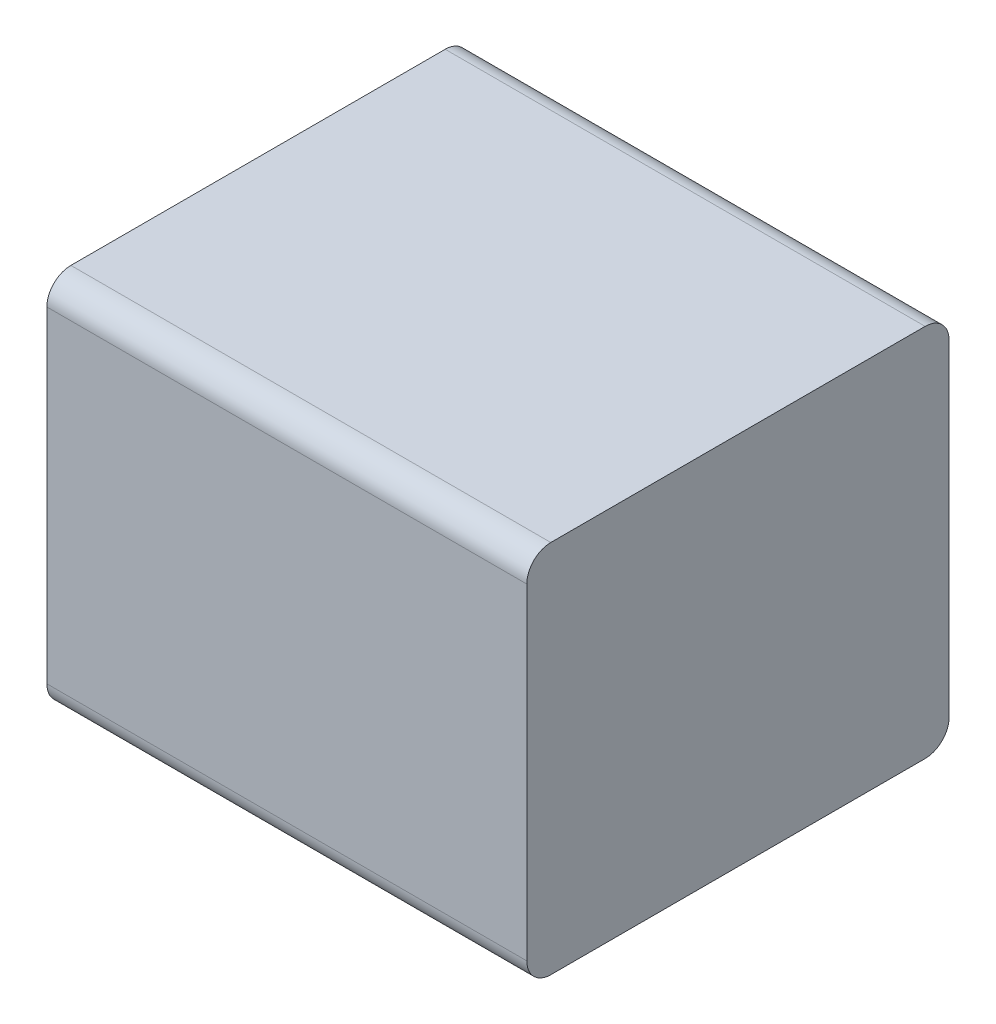
ISO-10303-21;
HEADER;
FILE_DESCRIPTION(('STEP AP214'),'2;1');
FILE_NAME('part.step','',(''),(''),'','','');
FILE_SCHEMA(('AUTOMOTIVE_DESIGN { 1 0 10303 214 1 1 1 1 }'));
ENDSEC;
DATA;
#1=APPLICATION_CONTEXT('core data for automotive mechanical design processes');
#2=APPLICATION_PROTOCOL_DEFINITION('international standard','automotive_design',2000,#1);
#3=PRODUCT_CONTEXT('',#1,'mechanical');
#4=PRODUCT('Part','Part','',(#3));
#5=PRODUCT_RELATED_PRODUCT_CATEGORY('part','',(#4));
#6=PRODUCT_DEFINITION_FORMATION('','',#4);
#7=PRODUCT_DEFINITION_CONTEXT('part definition',#1,'design');
#8=PRODUCT_DEFINITION('design','',#6,#7);
#9=PRODUCT_DEFINITION_SHAPE('','',#8);
#10=(LENGTH_UNIT() NAMED_UNIT(*) SI_UNIT(.MILLI.,.METRE.));
#11=(NAMED_UNIT(*) PLANE_ANGLE_UNIT() SI_UNIT($,.RADIAN.));
#12=(NAMED_UNIT(*) SI_UNIT($,.STERADIAN.) SOLID_ANGLE_UNIT());
#13=UNCERTAINTY_MEASURE_WITH_UNIT(LENGTH_MEASURE(1.E-05),#10,'distance_accuracy_value','');
#14=(GEOMETRIC_REPRESENTATION_CONTEXT(3) GLOBAL_UNCERTAINTY_ASSIGNED_CONTEXT((#13)) GLOBAL_UNIT_ASSIGNED_CONTEXT((#10,
#11,#12)) REPRESENTATION_CONTEXT('',''));
#15=CARTESIAN_POINT('',(0.,0.,0.));
#16=DIRECTION('',(0.,0.,1.));
#17=DIRECTION('',(1.,0.,0.));
#18=AXIS2_PLACEMENT_3D('',#15,#16,#17);
#19=CARTESIAN_POINT('',(0.,-0.34,0.0599999999999962));
#20=DIRECTION('',(1.,0.,0.));
#21=DIRECTION('',(0.,0.,-1.));
#22=AXIS2_PLACEMENT_3D('',#19,#20,#21);
#23=CYLINDRICAL_SURFACE('',#22,0.05);
#24=CARTESIAN_POINT('',(-0.499999999999989,-0.34,0.0599999999999926));
#25=DIRECTION('',(-1.,0.,0.));
#26=DIRECTION('',(0.,0.,-1.));
#27=AXIS2_PLACEMENT_3D('',#24,#25,#26);
#28=CIRCLE('',#27,0.05);
#29=CARTESIAN_POINT('',(-0.499999999999989,-0.34,0.00999999999999254));
#30=VERTEX_POINT('',#29);
#31=CARTESIAN_POINT('',(-0.499999999999989,-0.39,0.0599999999999962));
#32=VERTEX_POINT('',#31);
#33=EDGE_CURVE('E138',#30,#32,#28,.T.);
#34=ORIENTED_EDGE('',*,*,#33,.F.);
#35=DIRECTION('',(-1.,0.,0.));
#36=VECTOR('',#35,1.);
#37=CARTESIAN_POINT('',(0.,-0.34,0.00999999999999619));
#38=LINE('',#37,#36);
#39=CARTESIAN_POINT('',(0.5,-0.34,0.00999999999999984));
#40=VERTEX_POINT('',#39);
#41=EDGE_CURVE('E11',#40,#30,#38,.T.);
#42=ORIENTED_EDGE('',*,*,#41,.F.);
#43=CARTESIAN_POINT('',(0.5,-0.34,0.06));
#44=DIRECTION('',(1.,0.,0.));
#45=DIRECTION('',(0.,0.,-1.));
#46=AXIS2_PLACEMENT_3D('',#43,#44,#45);
#47=CIRCLE('',#46,0.05);
#48=CARTESIAN_POINT('',(0.5,-0.39,0.06));
#49=VERTEX_POINT('',#48);
#50=EDGE_CURVE('E164',#49,#40,#47,.T.);
#51=ORIENTED_EDGE('',*,*,#50,.F.);
#52=DIRECTION('',(-1.,0.,0.));
#53=VECTOR('',#52,1.);
#54=CARTESIAN_POINT('',(0.,-0.39,0.06));
#55=LINE('',#54,#53);
#56=EDGE_CURVE('E180',#49,#32,#55,.T.);
#57=ORIENTED_EDGE('',*,*,#56,.T.);
#58=EDGE_LOOP('',(#34,#42,#51,#57));
#59=FACE_BOUND('',#58,.T.);
#60=ADVANCED_FACE('F16',(#59),#23,.T.);
#61=CARTESIAN_POINT('',(0.,-0.39,0.00999999999999619));
#62=DIRECTION('',(0.,0.,-1.));
#63=DIRECTION('',(0.,-1.,0.));
#64=AXIS2_PLACEMENT_3D('',#61,#62,#63);
#65=PLANE('',#64);
#66=DIRECTION('',(-1.,0.,0.));
#67=VECTOR('',#66,1.);
#68=CARTESIAN_POINT('',(0.,0.34,0.0099999999999962));
#69=LINE('',#68,#67);
#70=CARTESIAN_POINT('',(0.5,0.34,0.00999999999999984));
#71=VERTEX_POINT('',#70);
#72=CARTESIAN_POINT('',(-0.499999999999989,0.34,0.00999999999999253));
#73=VERTEX_POINT('',#72);
#74=EDGE_CURVE('E122',#71,#73,#69,.T.);
#75=ORIENTED_EDGE('',*,*,#74,.F.);
#76=DIRECTION('',(0.,1.,0.));
#77=VECTOR('',#76,1.);
#78=CARTESIAN_POINT('',(0.5,-0.39,0.00999999999999986));
#79=LINE('',#78,#77);
#80=EDGE_CURVE('E161',#40,#71,#79,.T.);
#81=ORIENTED_EDGE('',*,*,#80,.F.);
#82=ORIENTED_EDGE('',*,*,#41,.T.);
#83=DIRECTION('',(0.,-1.,0.));
#84=VECTOR('',#83,1.);
#85=CARTESIAN_POINT('',(-0.499999999999989,-0.39,0.00999999999999249));
#86=LINE('',#85,#84);
#87=EDGE_CURVE('E133',#73,#30,#86,.T.);
#88=ORIENTED_EDGE('',*,*,#87,.F.);
#89=EDGE_LOOP('',(#75,#81,#82,#88));
#90=FACE_BOUND('',#89,.T.);
#91=ADVANCED_FACE('F134',(#90),#65,.T.);
#92=CARTESIAN_POINT('',(0.,-0.39,0.89));
#93=DIRECTION('',(0.,0.,1.));
#94=DIRECTION('',(1.,0.,0.));
#95=AXIS2_PLACEMENT_3D('',#92,#93,#94);
#96=PLANE('',#95);
#97=DIRECTION('',(-1.,0.,0.));
#98=VECTOR('',#97,1.);
#99=CARTESIAN_POINT('',(0.,-0.34,0.89));
#100=LINE('',#99,#98);
#101=CARTESIAN_POINT('',(0.50000000000001,-0.34,0.89));
#102=VERTEX_POINT('',#101);
#103=CARTESIAN_POINT('',(-0.499999999999989,-0.34,0.89));
#104=VERTEX_POINT('',#103);
#105=EDGE_CURVE('E27',#102,#104,#100,.T.);
#106=ORIENTED_EDGE('',*,*,#105,.F.);
#107=DIRECTION('',(0.,-1.,0.));
#108=VECTOR('',#107,1.);
#109=CARTESIAN_POINT('',(0.50000000000001,-0.39,0.89));
#110=LINE('',#109,#108);
#111=CARTESIAN_POINT('',(0.500000000000011,0.34,0.89));
#112=VERTEX_POINT('',#111);
#113=EDGE_CURVE('E169',#112,#102,#110,.T.);
#114=ORIENTED_EDGE('',*,*,#113,.F.);
#115=DIRECTION('',(1.,0.,0.));
#116=VECTOR('',#115,1.);
#117=CARTESIAN_POINT('',(0.,0.34,0.89));
#118=LINE('',#117,#116);
#119=CARTESIAN_POINT('',(-0.499999999999989,0.34,0.89));
#120=VERTEX_POINT('',#119);
#121=EDGE_CURVE('E144',#120,#112,#118,.T.);
#122=ORIENTED_EDGE('',*,*,#121,.F.);
#123=DIRECTION('',(0.,1.,0.));
#124=VECTOR('',#123,1.);
#125=CARTESIAN_POINT('',(-0.499999999999989,-0.39,0.89));
#126=LINE('',#125,#124);
#127=EDGE_CURVE('E20',#104,#120,#126,.T.);
#128=ORIENTED_EDGE('',*,*,#127,.F.);
#129=EDGE_LOOP('',(#106,#114,#122,#128));
#130=FACE_BOUND('',#129,.T.);
#131=ADVANCED_FACE('F294',(#130),#96,.T.);
#132=CARTESIAN_POINT('',(0.,-0.34,0.84));
#133=DIRECTION('',(-1.,0.,0.));
#134=DIRECTION('',(0.,0.,1.));
#135=AXIS2_PLACEMENT_3D('',#132,#133,#134);
#136=CYLINDRICAL_SURFACE('',#135,0.05);
#137=CARTESIAN_POINT('',(0.50000000000001,-0.34,0.84));
#138=DIRECTION('',(1.,0.,0.));
#139=DIRECTION('',(0.,0.,1.));
#140=AXIS2_PLACEMENT_3D('',#137,#138,#139);
#141=CIRCLE('',#140,0.05);
#142=CARTESIAN_POINT('',(0.50000000000001,-0.39,0.84));
#143=VERTEX_POINT('',#142);
#144=EDGE_CURVE('E154',#102,#143,#141,.T.);
#145=ORIENTED_EDGE('',*,*,#144,.F.);
#146=ORIENTED_EDGE('',*,*,#105,.T.);
#147=CARTESIAN_POINT('',(-0.499999999999989,-0.34,0.84));
#148=DIRECTION('',(-1.,0.,0.));
#149=DIRECTION('',(0.,0.,1.));
#150=AXIS2_PLACEMENT_3D('',#147,#148,#149);
#151=CIRCLE('',#150,0.05);
#152=CARTESIAN_POINT('',(-0.499999999999989,-0.39,0.84));
#153=VERTEX_POINT('',#152);
#154=EDGE_CURVE('E177',#153,#104,#151,.T.);
#155=ORIENTED_EDGE('',*,*,#154,.F.);
#156=DIRECTION('',(1.,0.,0.));
#157=VECTOR('',#156,1.);
#158=CARTESIAN_POINT('',(0.,-0.39,0.84));
#159=LINE('',#158,#157);
#160=EDGE_CURVE('E130',#153,#143,#159,.T.);
#161=ORIENTED_EDGE('',*,*,#160,.T.);
#162=EDGE_LOOP('',(#145,#146,#155,#161));
#163=FACE_BOUND('',#162,.T.);
#164=ADVANCED_FACE('F18',(#163),#136,.T.);
#165=CARTESIAN_POINT('',(0.,-0.39,0.45));
#166=DIRECTION('',(0.,1.,0.));
#167=DIRECTION('',(0.,0.,-1.));
#168=AXIS2_PLACEMENT_3D('',#165,#166,#167);
#169=PLANE('',#168);
#170=DIRECTION('',(0.,0.,-1.));
#171=VECTOR('',#170,1.);
#172=CARTESIAN_POINT('',(0.5,-0.39,0.45));
#173=LINE('',#172,#171);
#174=EDGE_CURVE('E157',#143,#49,#173,.T.);
#175=ORIENTED_EDGE('',*,*,#174,.F.);
#176=ORIENTED_EDGE('',*,*,#160,.F.);
#177=DIRECTION('',(0.,0.,1.));
#178=VECTOR('',#177,1.);
#179=CARTESIAN_POINT('',(-0.499999999999989,-0.39,0.449999999999993));
#180=LINE('',#179,#178);
#181=EDGE_CURVE('E173',#32,#153,#180,.T.);
#182=ORIENTED_EDGE('',*,*,#181,.F.);
#183=ORIENTED_EDGE('',*,*,#56,.F.);
#184=EDGE_LOOP('',(#175,#176,#182,#183));
#185=FACE_BOUND('',#184,.T.);
#186=ADVANCED_FACE('F215',(#185),#169,.F.);
#187=CARTESIAN_POINT('',(0.,0.34,0.0599999999999962));
#188=DIRECTION('',(1.,0.,0.));
#189=DIRECTION('',(0.,0.,-1.));
#190=AXIS2_PLACEMENT_3D('',#187,#188,#189);
#191=CYLINDRICAL_SURFACE('',#190,0.05);
#192=CARTESIAN_POINT('',(-0.499999999999989,0.34,0.0599999999999926));
#193=DIRECTION('',(-1.,0.,0.));
#194=DIRECTION('',(0.,0.,-1.));
#195=AXIS2_PLACEMENT_3D('',#192,#193,#194);
#196=CIRCLE('',#195,0.05);
#197=CARTESIAN_POINT('',(-0.499999999999989,0.39,0.0599999999999962));
#198=VERTEX_POINT('',#197);
#199=EDGE_CURVE('E126',#198,#73,#196,.T.);
#200=ORIENTED_EDGE('',*,*,#199,.F.);
#201=DIRECTION('',(-1.,0.,0.));
#202=VECTOR('',#201,1.);
#203=CARTESIAN_POINT('',(0.,0.39,0.06));
#204=LINE('',#203,#202);
#205=CARTESIAN_POINT('',(0.5,0.39,0.06));
#206=VERTEX_POINT('',#205);
#207=EDGE_CURVE('E160',#206,#198,#204,.T.);
#208=ORIENTED_EDGE('',*,*,#207,.F.);
#209=CARTESIAN_POINT('',(0.5,0.34,0.06));
#210=DIRECTION('',(1.,0.,0.));
#211=DIRECTION('',(0.,0.,-1.));
#212=AXIS2_PLACEMENT_3D('',#209,#210,#211);
#213=CIRCLE('',#212,0.05);
#214=EDGE_CURVE('E108',#71,#206,#213,.T.);
#215=ORIENTED_EDGE('',*,*,#214,.F.);
#216=ORIENTED_EDGE('',*,*,#74,.T.);
#217=EDGE_LOOP('',(#200,#208,#215,#216));
#218=FACE_BOUND('',#217,.T.);
#219=ADVANCED_FACE('F124',(#218),#191,.T.);
#220=CARTESIAN_POINT('',(-0.499999999999989,-0.39,0.449999999999993));
#221=DIRECTION('',(-1.,0.,0.));
#222=DIRECTION('',(0.,0.,1.));
#223=AXIS2_PLACEMENT_3D('',#220,#221,#222);
#224=PLANE('',#223);
#225=ORIENTED_EDGE('',*,*,#199,.T.);
#226=ORIENTED_EDGE('',*,*,#87,.T.);
#227=ORIENTED_EDGE('',*,*,#33,.T.);
#228=ORIENTED_EDGE('',*,*,#181,.T.);
#229=ORIENTED_EDGE('',*,*,#154,.T.);
#230=ORIENTED_EDGE('',*,*,#127,.T.);
#231=CARTESIAN_POINT('',(-0.499999999999989,0.34,0.84));
#232=DIRECTION('',(1.,0.,0.));
#233=DIRECTION('',(0.,0.,1.));
#234=AXIS2_PLACEMENT_3D('',#231,#232,#233);
#235=CIRCLE('',#234,0.05);
#236=CARTESIAN_POINT('',(-0.499999999999989,0.39,0.84));
#237=VERTEX_POINT('',#236);
#238=EDGE_CURVE('E87',#237,#120,#235,.T.);
#239=ORIENTED_EDGE('',*,*,#238,.F.);
#240=DIRECTION('',(0.,0.,1.));
#241=VECTOR('',#240,1.);
#242=CARTESIAN_POINT('',(-0.499999999999989,0.39,0.45));
#243=LINE('',#242,#241);
#244=EDGE_CURVE('E141',#198,#237,#243,.T.);
#245=ORIENTED_EDGE('',*,*,#244,.F.);
#246=EDGE_LOOP('',(#225,#226,#227,#228,#229,#230,#239,#245));
#247=FACE_BOUND('',#246,.T.);
#248=ADVANCED_FACE('F140',(#247),#224,.T.);
#249=CARTESIAN_POINT('',(0.,0.34,0.84));
#250=DIRECTION('',(-1.,0.,0.));
#251=DIRECTION('',(0.,0.,1.));
#252=AXIS2_PLACEMENT_3D('',#249,#250,#251);
#253=CYLINDRICAL_SURFACE('',#252,0.05);
#254=CARTESIAN_POINT('',(0.500000000000011,0.34,0.84));
#255=DIRECTION('',(1.,0.,0.));
#256=DIRECTION('',(0.,0.,1.));
#257=AXIS2_PLACEMENT_3D('',#254,#255,#256);
#258=CIRCLE('',#257,0.05);
#259=CARTESIAN_POINT('',(0.50000000000001,0.39,0.84));
#260=VERTEX_POINT('',#259);
#261=EDGE_CURVE('E97',#260,#112,#258,.T.);
#262=ORIENTED_EDGE('',*,*,#261,.F.);
#263=DIRECTION('',(1.,0.,0.));
#264=VECTOR('',#263,1.);
#265=CARTESIAN_POINT('',(0.,0.39,0.84));
#266=LINE('',#265,#264);
#267=EDGE_CURVE('E197',#237,#260,#266,.T.);
#268=ORIENTED_EDGE('',*,*,#267,.F.);
#269=ORIENTED_EDGE('',*,*,#238,.T.);
#270=ORIENTED_EDGE('',*,*,#121,.T.);
#271=EDGE_LOOP('',(#262,#268,#269,#270));
#272=FACE_BOUND('',#271,.T.);
#273=ADVANCED_FACE('F243',(#272),#253,.T.);
#274=CARTESIAN_POINT('',(0.5,-0.39,0.45));
#275=DIRECTION('',(1.,0.,0.));
#276=DIRECTION('',(0.,0.,-1.));
#277=AXIS2_PLACEMENT_3D('',#274,#275,#276);
#278=PLANE('',#277);
#279=ORIENTED_EDGE('',*,*,#144,.T.);
#280=ORIENTED_EDGE('',*,*,#174,.T.);
#281=ORIENTED_EDGE('',*,*,#50,.T.);
#282=ORIENTED_EDGE('',*,*,#80,.T.);
#283=ORIENTED_EDGE('',*,*,#214,.T.);
#284=DIRECTION('',(0.,0.,-1.));
#285=VECTOR('',#284,1.);
#286=CARTESIAN_POINT('',(0.50000000000001,0.39,0.45));
#287=LINE('',#286,#285);
#288=EDGE_CURVE('E193',#260,#206,#287,.T.);
#289=ORIENTED_EDGE('',*,*,#288,.F.);
#290=ORIENTED_EDGE('',*,*,#261,.T.);
#291=ORIENTED_EDGE('',*,*,#113,.T.);
#292=EDGE_LOOP('',(#279,#280,#281,#282,#283,#289,#290,#291));
#293=FACE_BOUND('',#292,.T.);
#294=ADVANCED_FACE('F255',(#293),#278,.T.);
#295=CARTESIAN_POINT('',(0.,0.39,0.45));
#296=DIRECTION('',(0.,1.,0.));
#297=DIRECTION('',(0.,0.,-1.));
#298=AXIS2_PLACEMENT_3D('',#295,#296,#297);
#299=PLANE('',#298);
#300=ORIENTED_EDGE('',*,*,#267,.T.);
#301=ORIENTED_EDGE('',*,*,#288,.T.);
#302=ORIENTED_EDGE('',*,*,#207,.T.);
#303=ORIENTED_EDGE('',*,*,#244,.T.);
#304=EDGE_LOOP('',(#300,#301,#302,#303));
#305=FACE_BOUND('',#304,.T.);
#306=ADVANCED_FACE('F251',(#305),#299,.T.);
#307=CLOSED_SHELL('',(#60,#91,#131,#164,#186,#219,#248,#273,#294,#306));
#308=MANIFOLD_SOLID_BREP('B1',#307);
#309=ADVANCED_BREP_SHAPE_REPRESENTATION('',(#18,#308),#14);
#310=SHAPE_DEFINITION_REPRESENTATION(#9,#309);
ENDSEC;
END-ISO-10303-21;
